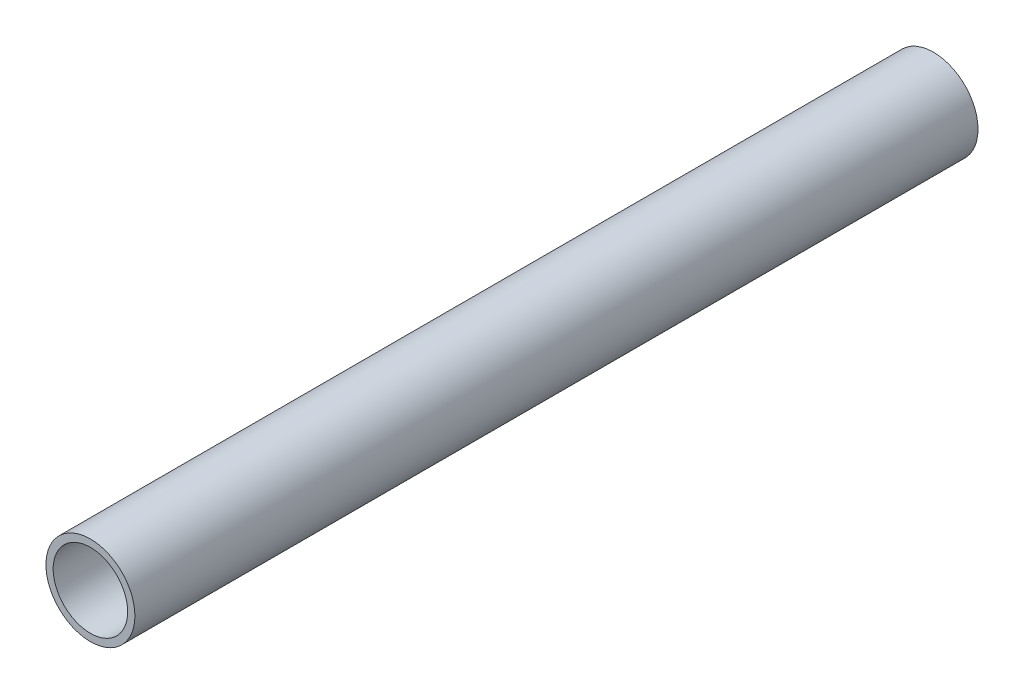
ISO-10303-21;
HEADER;
FILE_DESCRIPTION(('STEP AP214'),'2;1');
FILE_NAME('part.step','',(''),(''),'','','');
FILE_SCHEMA(('AUTOMOTIVE_DESIGN { 1 0 10303 214 1 1 1 1 }'));
ENDSEC;
DATA;
#1=APPLICATION_CONTEXT('core data for automotive mechanical design processes');
#2=APPLICATION_PROTOCOL_DEFINITION('international standard','automotive_design',2000,#1);
#3=PRODUCT_CONTEXT('',#1,'mechanical');
#4=PRODUCT('Part','Part','',(#3));
#5=PRODUCT_RELATED_PRODUCT_CATEGORY('part','',(#4));
#6=PRODUCT_DEFINITION_FORMATION('','',#4);
#7=PRODUCT_DEFINITION_CONTEXT('part definition',#1,'design');
#8=PRODUCT_DEFINITION('design','',#6,#7);
#9=PRODUCT_DEFINITION_SHAPE('','',#8);
#10=(LENGTH_UNIT() NAMED_UNIT(*) SI_UNIT(.MILLI.,.METRE.));
#11=(NAMED_UNIT(*) PLANE_ANGLE_UNIT() SI_UNIT($,.RADIAN.));
#12=(NAMED_UNIT(*) SI_UNIT($,.STERADIAN.) SOLID_ANGLE_UNIT());
#13=UNCERTAINTY_MEASURE_WITH_UNIT(LENGTH_MEASURE(1.E-05),#10,'distance_accuracy_value','');
#14=(GEOMETRIC_REPRESENTATION_CONTEXT(3) GLOBAL_UNCERTAINTY_ASSIGNED_CONTEXT((#13)) GLOBAL_UNIT_ASSIGNED_CONTEXT((#10,
#11,#12)) REPRESENTATION_CONTEXT('',''));
#15=CARTESIAN_POINT('',(0.,0.,0.));
#16=DIRECTION('',(0.,0.,1.));
#17=DIRECTION('',(1.,0.,0.));
#18=AXIS2_PLACEMENT_3D('',#15,#16,#17);
#19=CARTESIAN_POINT('',(0.,0.,457.2));
#20=DIRECTION('',(0.,0.,1.));
#21=DIRECTION('',(1.,0.,0.));
#22=AXIS2_PLACEMENT_3D('',#19,#20,#21);
#23=PLANE('',#22);
#24=CARTESIAN_POINT('',(0.,0.,457.2));
#25=DIRECTION('',(0.,0.,1.));
#26=DIRECTION('',(1.,0.,0.));
#27=AXIS2_PLACEMENT_3D('',#24,#25,#26);
#28=CIRCLE('',#27,24.13);
#29=CARTESIAN_POINT('',(24.13,0.,457.2));
#30=VERTEX_POINT('',#29);
#31=EDGE_CURVE('E12',#30,#30,#28,.T.);
#32=ORIENTED_EDGE('',*,*,#31,.T.);
#33=EDGE_LOOP('',(#32));
#34=FACE_BOUND('',#33,.T.);
#35=CARTESIAN_POINT('',(0.,0.,457.2));
#36=DIRECTION('',(0.,0.,1.));
#37=DIRECTION('',(1.,0.,0.));
#38=AXIS2_PLACEMENT_3D('',#35,#36,#37);
#39=CIRCLE('',#38,20.193);
#40=CARTESIAN_POINT('',(20.193,0.,457.2));
#41=VERTEX_POINT('',#40);
#42=EDGE_CURVE('E56',#41,#41,#39,.T.);
#43=ORIENTED_EDGE('',*,*,#42,.F.);
#44=EDGE_LOOP('',(#43));
#45=FACE_BOUND('',#44,.T.);
#46=ADVANCED_FACE('F45',(#34,#45),#23,.T.);
#47=CARTESIAN_POINT('',(0.,0.,0.));
#48=DIRECTION('',(0.,0.,1.));
#49=DIRECTION('',(1.,0.,0.));
#50=AXIS2_PLACEMENT_3D('',#47,#48,#49);
#51=PLANE('',#50);
#52=CARTESIAN_POINT('',(0.,0.,0.));
#53=DIRECTION('',(0.,0.,1.));
#54=DIRECTION('',(1.,0.,0.));
#55=AXIS2_PLACEMENT_3D('',#52,#53,#54);
#56=CIRCLE('',#55,24.13);
#57=CARTESIAN_POINT('',(24.13,0.,0.));
#58=VERTEX_POINT('',#57);
#59=EDGE_CURVE('E49',#58,#58,#56,.T.);
#60=ORIENTED_EDGE('',*,*,#59,.F.);
#61=EDGE_LOOP('',(#60));
#62=FACE_BOUND('',#61,.T.);
#63=CARTESIAN_POINT('',(0.,0.,0.));
#64=DIRECTION('',(0.,0.,1.));
#65=DIRECTION('',(1.,0.,0.));
#66=AXIS2_PLACEMENT_3D('',#63,#64,#65);
#67=CIRCLE('',#66,20.193);
#68=CARTESIAN_POINT('',(20.193,0.,0.));
#69=VERTEX_POINT('',#68);
#70=EDGE_CURVE('E58',#69,#69,#67,.T.);
#71=ORIENTED_EDGE('',*,*,#70,.T.);
#72=EDGE_LOOP('',(#71));
#73=FACE_BOUND('',#72,.T.);
#74=ADVANCED_FACE('F68',(#62,#73),#51,.F.);
#75=CARTESIAN_POINT('',(0.,0.,457.2));
#76=DIRECTION('',(0.,0.,-1.));
#77=DIRECTION('',(-1.,0.,0.));
#78=AXIS2_PLACEMENT_3D('',#75,#76,#77);
#79=CYLINDRICAL_SURFACE('',#78,24.13);
#80=ORIENTED_EDGE('',*,*,#31,.F.);
#81=EDGE_LOOP('',(#80));
#82=FACE_BOUND('',#81,.T.);
#83=ORIENTED_EDGE('',*,*,#59,.T.);
#84=EDGE_LOOP('',(#83));
#85=FACE_BOUND('',#84,.T.);
#86=ADVANCED_FACE('F47',(#82,#85),#79,.T.);
#87=CARTESIAN_POINT('',(0.,0.,457.2));
#88=DIRECTION('',(0.,0.,-1.));
#89=DIRECTION('',(-1.,0.,0.));
#90=AXIS2_PLACEMENT_3D('',#87,#88,#89);
#91=CYLINDRICAL_SURFACE('',#90,20.193);
#92=ORIENTED_EDGE('',*,*,#42,.T.);
#93=EDGE_LOOP('',(#92));
#94=FACE_BOUND('',#93,.T.);
#95=ORIENTED_EDGE('',*,*,#70,.F.);
#96=EDGE_LOOP('',(#95));
#97=FACE_BOUND('',#96,.T.);
#98=ADVANCED_FACE('F64',(#94,#97),#91,.F.);
#99=CLOSED_SHELL('',(#46,#74,#86,#98));
#100=MANIFOLD_SOLID_BREP('B2',#99);
#101=ADVANCED_BREP_SHAPE_REPRESENTATION('',(#18,#100),#14);
#102=SHAPE_DEFINITION_REPRESENTATION(#9,#101);
ENDSEC;
END-ISO-10303-21;
